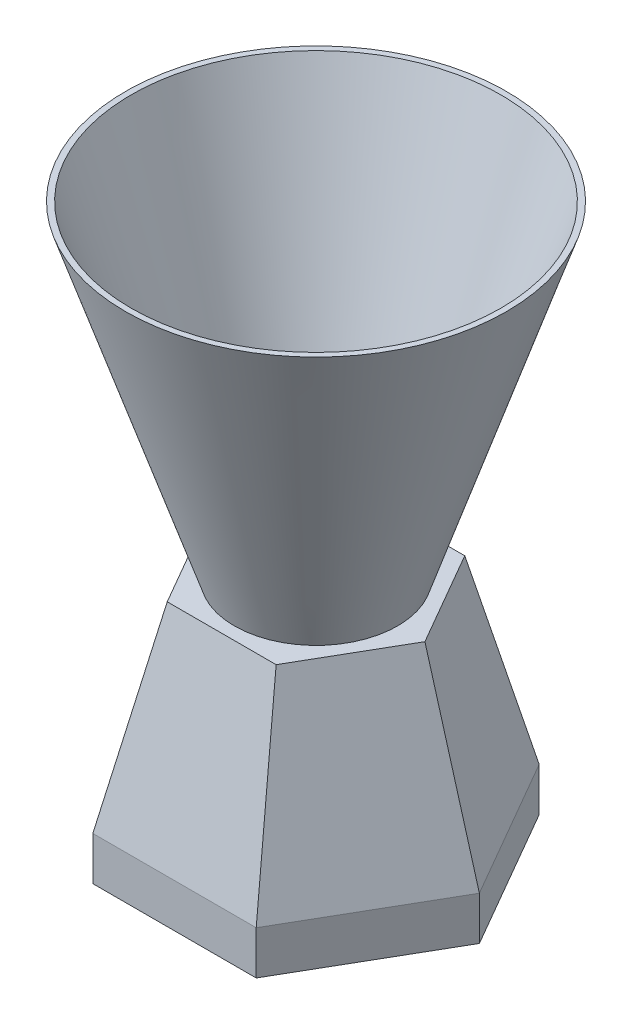
ISO-10303-21;
HEADER;
FILE_DESCRIPTION(('STEP AP214'),'2;1');
FILE_NAME('part.step','',(''),(''),'','','');
FILE_SCHEMA(('AUTOMOTIVE_DESIGN { 1 0 10303 214 1 1 1 1 }'));
ENDSEC;
DATA;
#1=APPLICATION_CONTEXT('core data for automotive mechanical design processes');
#2=APPLICATION_PROTOCOL_DEFINITION('international standard','automotive_design',2000,#1);
#3=PRODUCT_CONTEXT('',#1,'mechanical');
#4=PRODUCT('Part','Part','',(#3));
#5=PRODUCT_RELATED_PRODUCT_CATEGORY('part','',(#4));
#6=PRODUCT_DEFINITION_FORMATION('','',#4);
#7=PRODUCT_DEFINITION_CONTEXT('part definition',#1,'design');
#8=PRODUCT_DEFINITION('design','',#6,#7);
#9=PRODUCT_DEFINITION_SHAPE('','',#8);
#10=(LENGTH_UNIT() NAMED_UNIT(*) SI_UNIT(.MILLI.,.METRE.));
#11=(NAMED_UNIT(*) PLANE_ANGLE_UNIT() SI_UNIT($,.RADIAN.));
#12=(NAMED_UNIT(*) SI_UNIT($,.STERADIAN.) SOLID_ANGLE_UNIT());
#13=UNCERTAINTY_MEASURE_WITH_UNIT(LENGTH_MEASURE(1.E-05),#10,'distance_accuracy_value','');
#14=(GEOMETRIC_REPRESENTATION_CONTEXT(3) GLOBAL_UNCERTAINTY_ASSIGNED_CONTEXT((#13)) GLOBAL_UNIT_ASSIGNED_CONTEXT((#10,
#11,#12)) REPRESENTATION_CONTEXT('',''));
#15=CARTESIAN_POINT('',(0.,0.,0.));
#16=DIRECTION('',(0.,0.,1.));
#17=DIRECTION('',(1.,0.,0.));
#18=AXIS2_PLACEMENT_3D('',#15,#16,#17);
#19=CARTESIAN_POINT('',(-20.,43.,0.));
#20=DIRECTION('',(0.,1.,0.));
#21=DIRECTION('',(0.,0.,1.));
#22=AXIS2_PLACEMENT_3D('',#19,#20,#21);
#23=PLANE('',#22);
#24=CARTESIAN_POINT('',(0.,43.,0.));
#25=DIRECTION('',(0.,1.,0.));
#26=DIRECTION('',(0.,0.,1.));
#27=AXIS2_PLACEMENT_3D('',#24,#25,#26);
#28=CIRCLE('',#27,15.);
#29=CARTESIAN_POINT('',(0.,43.,15.));
#30=VERTEX_POINT('',#29);
#31=EDGE_CURVE('E12',#30,#30,#28,.T.);
#32=ORIENTED_EDGE('',*,*,#31,.F.);
#33=EDGE_LOOP('',(#32));
#34=FACE_BOUND('',#33,.T.);
#35=DIRECTION('',(-0.499999999999999,0.,0.866025403784439));
#36=VECTOR('',#35,1.);
#37=CARTESIAN_POINT('',(-10.,43.,-17.3205080756888));
#38=LINE('',#37,#36);
#39=CARTESIAN_POINT('',(-10.,43.,-17.3205080756888));
#40=VERTEX_POINT('',#39);
#41=CARTESIAN_POINT('',(-20.,43.,0.));
#42=VERTEX_POINT('',#41);
#43=EDGE_CURVE('E152',#40,#42,#38,.T.);
#44=ORIENTED_EDGE('',*,*,#43,.T.);
#45=DIRECTION('',(0.5,0.,0.866025403784439));
#46=VECTOR('',#45,1.);
#47=CARTESIAN_POINT('',(-20.,43.,0.));
#48=LINE('',#47,#46);
#49=CARTESIAN_POINT('',(-9.99999999999999,43.,17.3205080756888));
#50=VERTEX_POINT('',#49);
#51=EDGE_CURVE('E136',#42,#50,#48,.T.);
#52=ORIENTED_EDGE('',*,*,#51,.T.);
#53=DIRECTION('',(1.,0.,0.));
#54=VECTOR('',#53,1.);
#55=CARTESIAN_POINT('',(-9.99999999999999,43.,17.3205080756888));
#56=LINE('',#55,#54);
#57=CARTESIAN_POINT('',(10.,43.,17.3205080756888));
#58=VERTEX_POINT('',#57);
#59=EDGE_CURVE('E123',#50,#58,#56,.T.);
#60=ORIENTED_EDGE('',*,*,#59,.T.);
#61=DIRECTION('',(0.5,0.,-0.866025403784439));
#62=VECTOR('',#61,1.);
#63=CARTESIAN_POINT('',(10.,43.,17.3205080756888));
#64=LINE('',#63,#62);
#65=CARTESIAN_POINT('',(20.,43.,0.));
#66=VERTEX_POINT('',#65);
#67=EDGE_CURVE('E135',#58,#66,#64,.T.);
#68=ORIENTED_EDGE('',*,*,#67,.T.);
#69=DIRECTION('',(-0.5,0.,-0.866025403784439));
#70=VECTOR('',#69,1.);
#71=CARTESIAN_POINT('',(20.,43.,0.));
#72=LINE('',#71,#70);
#73=CARTESIAN_POINT('',(10.,43.,-17.3205080756888));
#74=VERTEX_POINT('',#73);
#75=EDGE_CURVE('E210',#66,#74,#72,.T.);
#76=ORIENTED_EDGE('',*,*,#75,.T.);
#77=DIRECTION('',(-1.,0.,0.));
#78=VECTOR('',#77,1.);
#79=CARTESIAN_POINT('',(10.,43.,-17.3205080756888));
#80=LINE('',#79,#78);
#81=EDGE_CURVE('E257',#74,#40,#80,.T.);
#82=ORIENTED_EDGE('',*,*,#81,.T.);
#83=EDGE_LOOP('',(#44,#52,#60,#68,#76,#82));
#84=FACE_BOUND('',#83,.T.);
#85=ADVANCED_FACE('F45',(#34,#84),#23,.T.);
#86=CARTESIAN_POINT('',(15.,8.,25.9807621135332));
#87=DIRECTION('',(-0.866025403784439,0.,-0.499999999999999));
#88=DIRECTION('',(-0.5,0.,0.866025403784439));
#89=AXIS2_PLACEMENT_3D('',#86,#87,#88);
#90=PLANE('',#89);
#91=DIRECTION('',(0.499999999999999,0.,-0.866025403784439));
#92=VECTOR('',#91,1.);
#93=CARTESIAN_POINT('',(15.,0.,25.9807621135332));
#94=LINE('',#93,#92);
#95=CARTESIAN_POINT('',(15.,0.,25.9807621135332));
#96=VERTEX_POINT('',#95);
#97=CARTESIAN_POINT('',(30.,0.,0.));
#98=VERTEX_POINT('',#97);
#99=EDGE_CURVE('E147',#96,#98,#94,.T.);
#100=ORIENTED_EDGE('',*,*,#99,.T.);
#101=DIRECTION('',(0.,-1.,0.));
#102=VECTOR('',#101,1.);
#103=CARTESIAN_POINT('',(30.,8.,0.));
#104=LINE('',#103,#102);
#105=CARTESIAN_POINT('',(30.,7.99999999999997,0.));
#106=VERTEX_POINT('',#105);
#107=EDGE_CURVE('E332',#106,#98,#104,.T.);
#108=ORIENTED_EDGE('',*,*,#107,.F.);
#109=DIRECTION('',(-0.5,0.,0.866025403784439));
#110=VECTOR('',#109,1.);
#111=CARTESIAN_POINT('',(27.5,7.99999999999997,4.33012701892219));
#112=LINE('',#111,#110);
#113=CARTESIAN_POINT('',(15.0000000000002,7.99999999999994,25.9807621135331));
#114=VERTEX_POINT('',#113);
#115=EDGE_CURVE('E328',#114,#106,#112,.F.);
#116=ORIENTED_EDGE('',*,*,#115,.F.);
#117=DIRECTION('',(0.,-1.,0.));
#118=VECTOR('',#117,1.);
#119=CARTESIAN_POINT('',(15.,8.,25.9807621135332));
#120=LINE('',#119,#118);
#121=EDGE_CURVE('E344',#114,#96,#120,.T.);
#122=ORIENTED_EDGE('',*,*,#121,.T.);
#123=EDGE_LOOP('',(#100,#108,#116,#122));
#124=FACE_BOUND('',#123,.T.);
#125=ADVANCED_FACE('F47',(#124),#90,.F.);
#126=CARTESIAN_POINT('',(30.,8.,0.));
#127=DIRECTION('',(-0.866025403784439,0.,0.5));
#128=DIRECTION('',(0.5,0.,0.866025403784439));
#129=AXIS2_PLACEMENT_3D('',#126,#127,#128);
#130=PLANE('',#129);
#131=DIRECTION('',(-0.5,0.,-0.866025403784439));
#132=VECTOR('',#131,1.);
#133=CARTESIAN_POINT('',(30.,0.,0.));
#134=LINE('',#133,#132);
#135=CARTESIAN_POINT('',(15.,0.,-25.9807621135332));
#136=VERTEX_POINT('',#135);
#137=EDGE_CURVE('E367',#98,#136,#134,.T.);
#138=ORIENTED_EDGE('',*,*,#137,.T.);
#139=DIRECTION('',(0.,-1.,0.));
#140=VECTOR('',#139,1.);
#141=CARTESIAN_POINT('',(15.,8.,-25.9807621135332));
#142=LINE('',#141,#140);
#143=CARTESIAN_POINT('',(15.,7.99999999999999,-25.9807621135331));
#144=VERTEX_POINT('',#143);
#145=EDGE_CURVE('E335',#144,#136,#142,.T.);
#146=ORIENTED_EDGE('',*,*,#145,.F.);
#147=DIRECTION('',(0.5,0.,0.866025403784439));
#148=VECTOR('',#147,1.);
#149=CARTESIAN_POINT('',(17.5,8.,-21.6506350946109));
#150=LINE('',#149,#148);
#151=EDGE_CURVE('E79',#106,#144,#150,.F.);
#152=ORIENTED_EDGE('',*,*,#151,.F.);
#153=ORIENTED_EDGE('',*,*,#107,.T.);
#154=EDGE_LOOP('',(#138,#146,#152,#153));
#155=FACE_BOUND('',#154,.T.);
#156=ADVANCED_FACE('F378',(#155),#130,.F.);
#157=CARTESIAN_POINT('',(15.,8.,-25.9807621135332));
#158=DIRECTION('',(0.,0.,1.));
#159=DIRECTION('',(1.,0.,0.));
#160=AXIS2_PLACEMENT_3D('',#157,#158,#159);
#161=PLANE('',#160);
#162=DIRECTION('',(-1.,0.,0.));
#163=VECTOR('',#162,1.);
#164=CARTESIAN_POINT('',(15.,0.,-25.9807621135332));
#165=LINE('',#164,#163);
#166=CARTESIAN_POINT('',(-15.,0.,-25.9807621135332));
#167=VERTEX_POINT('',#166);
#168=EDGE_CURVE('E364',#136,#167,#165,.T.);
#169=ORIENTED_EDGE('',*,*,#168,.T.);
#170=DIRECTION('',(0.,-1.,0.));
#171=VECTOR('',#170,1.);
#172=CARTESIAN_POINT('',(-15.,8.,-25.9807621135332));
#173=LINE('',#172,#171);
#174=CARTESIAN_POINT('',(-15.,7.99999999999997,-25.9807621135331));
#175=VERTEX_POINT('',#174);
#176=EDGE_CURVE('E338',#175,#167,#173,.T.);
#177=ORIENTED_EDGE('',*,*,#176,.F.);
#178=DIRECTION('',(1.,0.,0.));
#179=VECTOR('',#178,1.);
#180=CARTESIAN_POINT('',(-10.,7.99999999999997,-25.9807621135331));
#181=LINE('',#180,#179);
#182=EDGE_CURVE('E322',#144,#175,#181,.F.);
#183=ORIENTED_EDGE('',*,*,#182,.F.);
#184=ORIENTED_EDGE('',*,*,#145,.T.);
#185=EDGE_LOOP('',(#169,#177,#183,#184));
#186=FACE_BOUND('',#185,.T.);
#187=ADVANCED_FACE('F379',(#186),#161,.F.);
#188=CARTESIAN_POINT('',(-15.,8.,-25.9807621135332));
#189=DIRECTION('',(0.866025403784439,0.,0.5));
#190=DIRECTION('',(0.5,0.,-0.866025403784439));
#191=AXIS2_PLACEMENT_3D('',#188,#189,#190);
#192=PLANE('',#191);
#193=DIRECTION('',(-0.5,0.,0.866025403784439));
#194=VECTOR('',#193,1.);
#195=CARTESIAN_POINT('',(-15.,0.,-25.9807621135332));
#196=LINE('',#195,#194);
#197=CARTESIAN_POINT('',(-30.,0.,0.));
#198=VERTEX_POINT('',#197);
#199=EDGE_CURVE('E360',#167,#198,#196,.T.);
#200=ORIENTED_EDGE('',*,*,#199,.T.);
#201=DIRECTION('',(0.,-1.,0.));
#202=VECTOR('',#201,1.);
#203=CARTESIAN_POINT('',(-30.,8.,0.));
#204=LINE('',#203,#202);
#205=CARTESIAN_POINT('',(-29.9999999999999,7.99999999999996,0.));
#206=VERTEX_POINT('',#205);
#207=EDGE_CURVE('E349',#206,#198,#204,.T.);
#208=ORIENTED_EDGE('',*,*,#207,.F.);
#209=DIRECTION('',(0.499999999999999,0.,-0.866025403784439));
#210=VECTOR('',#209,1.);
#211=CARTESIAN_POINT('',(-27.4999999999999,7.99999999999997,-4.33012701892213));
#212=LINE('',#211,#210);
#213=EDGE_CURVE('E325',#175,#206,#212,.F.);
#214=ORIENTED_EDGE('',*,*,#213,.F.);
#215=ORIENTED_EDGE('',*,*,#176,.T.);
#216=EDGE_LOOP('',(#200,#208,#214,#215));
#217=FACE_BOUND('',#216,.T.);
#218=ADVANCED_FACE('F359',(#217),#192,.F.);
#219=CARTESIAN_POINT('',(-30.,8.,0.));
#220=DIRECTION('',(0.866025403784439,0.,-0.5));
#221=DIRECTION('',(-0.5,0.,-0.866025403784439));
#222=AXIS2_PLACEMENT_3D('',#219,#220,#221);
#223=PLANE('',#222);
#224=DIRECTION('',(0.5,0.,0.866025403784439));
#225=VECTOR('',#224,1.);
#226=CARTESIAN_POINT('',(-30.,0.,0.));
#227=LINE('',#226,#225);
#228=CARTESIAN_POINT('',(-15.,0.,25.9807621135332));
#229=VERTEX_POINT('',#228);
#230=EDGE_CURVE('E365',#198,#229,#227,.T.);
#231=ORIENTED_EDGE('',*,*,#230,.T.);
#232=DIRECTION('',(0.,-1.,0.));
#233=VECTOR('',#232,1.);
#234=CARTESIAN_POINT('',(-15.,8.,25.9807621135332));
#235=LINE('',#234,#233);
#236=CARTESIAN_POINT('',(-14.9999999999998,7.99999999999993,25.9807621135331));
#237=VERTEX_POINT('',#236);
#238=EDGE_CURVE('E62',#237,#229,#235,.T.);
#239=ORIENTED_EDGE('',*,*,#238,.F.);
#240=DIRECTION('',(-0.5,0.,-0.866025403784439));
#241=VECTOR('',#240,1.);
#242=CARTESIAN_POINT('',(-17.4999999999999,7.99999999999993,21.6506350946109));
#243=LINE('',#242,#241);
#244=EDGE_CURVE('E146',#206,#237,#243,.F.);
#245=ORIENTED_EDGE('',*,*,#244,.F.);
#246=ORIENTED_EDGE('',*,*,#207,.T.);
#247=EDGE_LOOP('',(#231,#239,#245,#246));
#248=FACE_BOUND('',#247,.T.);
#249=ADVANCED_FACE('F386',(#248),#223,.F.);
#250=CARTESIAN_POINT('',(-15.,8.,25.9807621135332));
#251=DIRECTION('',(0.,0.,-1.));
#252=DIRECTION('',(-1.,0.,0.));
#253=AXIS2_PLACEMENT_3D('',#250,#251,#252);
#254=PLANE('',#253);
#255=DIRECTION('',(1.,0.,0.));
#256=VECTOR('',#255,1.);
#257=CARTESIAN_POINT('',(-15.,0.,25.9807621135332));
#258=LINE('',#257,#256);
#259=EDGE_CURVE('E86',#229,#96,#258,.T.);
#260=ORIENTED_EDGE('',*,*,#259,.T.);
#261=ORIENTED_EDGE('',*,*,#121,.F.);
#262=DIRECTION('',(1.,0.,0.));
#263=VECTOR('',#262,1.);
#264=CARTESIAN_POINT('',(10.,7.99999999999992,25.980762113533));
#265=LINE('',#264,#263);
#266=EDGE_CURVE('E343',#237,#114,#265,.T.);
#267=ORIENTED_EDGE('',*,*,#266,.F.);
#268=ORIENTED_EDGE('',*,*,#238,.T.);
#269=EDGE_LOOP('',(#260,#261,#267,#268));
#270=FACE_BOUND('',#269,.T.);
#271=ADVANCED_FACE('F412',(#270),#254,.F.);
#272=CARTESIAN_POINT('',(30.,0.,0.));
#273=DIRECTION('',(0.,1.,0.));
#274=DIRECTION('',(0.,0.,1.));
#275=AXIS2_PLACEMENT_3D('',#272,#273,#274);
#276=PLANE('',#275);
#277=ORIENTED_EDGE('',*,*,#99,.F.);
#278=ORIENTED_EDGE('',*,*,#259,.F.);
#279=ORIENTED_EDGE('',*,*,#230,.F.);
#280=ORIENTED_EDGE('',*,*,#199,.F.);
#281=ORIENTED_EDGE('',*,*,#168,.F.);
#282=ORIENTED_EDGE('',*,*,#137,.F.);
#283=EDGE_LOOP('',(#277,#278,#279,#280,#281,#282));
#284=FACE_BOUND('',#283,.T.);
#285=ADVANCED_FACE('F176',(#284),#276,.F.);
#286=CARTESIAN_POINT('',(10.,43.,17.3205080756888));
#287=DIRECTION('',(0.,-0.240192230707626,-0.970725343394152));
#288=DIRECTION('',(0.,0.970725343394152,-0.240192230707626));
#289=AXIS2_PLACEMENT_3D('',#286,#287,#288);
#290=PLANE('',#289);
#291=DIRECTION('',(-0.137360563948697,0.961523947640823,-0.237915475715438));
#292=VECTOR('',#291,1.);
#293=CARTESIAN_POINT('',(15.0000000000003,8.,25.980762113533));
#294=LINE('',#293,#292);
#295=EDGE_CURVE('E130',#114,#58,#294,.T.);
#296=ORIENTED_EDGE('',*,*,#295,.T.);
#297=ORIENTED_EDGE('',*,*,#59,.F.);
#298=DIRECTION('',(0.137360563948682,0.961523947640823,-0.237915475715447));
#299=VECTOR('',#298,1.);
#300=CARTESIAN_POINT('',(-14.9999999999997,8.,25.9807621135333));
#301=LINE('',#300,#299);
#302=EDGE_CURVE('E128',#237,#50,#301,.T.);
#303=ORIENTED_EDGE('',*,*,#302,.F.);
#304=ORIENTED_EDGE('',*,*,#266,.T.);
#305=EDGE_LOOP('',(#296,#297,#303,#304));
#306=FACE_BOUND('',#305,.T.);
#307=ADVANCED_FACE('F126',(#306),#290,.F.);
#308=CARTESIAN_POINT('',(-9.99999999999999,43.,17.3205080756888));
#309=DIRECTION('',(0.840672807476708,-0.240192230707627,-0.485362671697076));
#310=DIRECTION('',(-0.5,0.,-0.866025403784439));
#311=AXIS2_PLACEMENT_3D('',#308,#309,#310);
#312=PLANE('',#311);
#313=ORIENTED_EDGE('',*,*,#302,.T.);
#314=ORIENTED_EDGE('',*,*,#51,.F.);
#315=DIRECTION('',(0.274721127897378,0.961523947640823,0.));
#316=VECTOR('',#315,1.);
#317=CARTESIAN_POINT('',(-30.,8.,2.13062446810531E-13));
#318=LINE('',#317,#316);
#319=EDGE_CURVE('E259',#206,#42,#318,.T.);
#320=ORIENTED_EDGE('',*,*,#319,.F.);
#321=ORIENTED_EDGE('',*,*,#244,.T.);
#322=EDGE_LOOP('',(#313,#314,#320,#321));
#323=FACE_BOUND('',#322,.T.);
#324=ADVANCED_FACE('F142',(#323),#312,.F.);
#325=CARTESIAN_POINT('',(20.,43.,0.));
#326=DIRECTION('',(-0.840672807476708,-0.240192230707631,-0.485362671697075));
#327=DIRECTION('',(-0.5,0.,0.866025403784439));
#328=AXIS2_PLACEMENT_3D('',#325,#326,#327);
#329=PLANE('',#328);
#330=DIRECTION('',(-0.274721127897378,0.961523947640823,0.));
#331=VECTOR('',#330,1.);
#332=CARTESIAN_POINT('',(30.,8.,0.));
#333=LINE('',#332,#331);
#334=EDGE_CURVE('E220',#106,#66,#333,.T.);
#335=ORIENTED_EDGE('',*,*,#334,.T.);
#336=ORIENTED_EDGE('',*,*,#67,.F.);
#337=ORIENTED_EDGE('',*,*,#295,.F.);
#338=ORIENTED_EDGE('',*,*,#115,.T.);
#339=EDGE_LOOP('',(#335,#336,#337,#338));
#340=FACE_BOUND('',#339,.T.);
#341=ADVANCED_FACE('F217',(#340),#329,.F.);
#342=CARTESIAN_POINT('',(10.,43.,-17.3205080756888));
#343=DIRECTION('',(-0.840672807476708,-0.240192230707629,0.485362671697076));
#344=DIRECTION('',(0.5,0.,0.866025403784439));
#345=AXIS2_PLACEMENT_3D('',#342,#343,#344);
#346=PLANE('',#345);
#347=DIRECTION('',(-0.137360563948687,0.961523947640823,0.237915475715444));
#348=VECTOR('',#347,1.);
#349=CARTESIAN_POINT('',(14.9999999999999,8.,-25.9807621135332));
#350=LINE('',#349,#348);
#351=EDGE_CURVE('E276',#144,#74,#350,.T.);
#352=ORIENTED_EDGE('',*,*,#351,.T.);
#353=ORIENTED_EDGE('',*,*,#75,.F.);
#354=ORIENTED_EDGE('',*,*,#334,.F.);
#355=ORIENTED_EDGE('',*,*,#151,.T.);
#356=EDGE_LOOP('',(#352,#353,#354,#355));
#357=FACE_BOUND('',#356,.T.);
#358=ADVANCED_FACE('F239',(#357),#346,.F.);
#359=CARTESIAN_POINT('',(-10.,43.,-17.3205080756888));
#360=DIRECTION('',(0.,-0.240192230707628,0.970725343394152));
#361=DIRECTION('',(0.,-0.970725343394152,-0.240192230707628));
#362=AXIS2_PLACEMENT_3D('',#359,#360,#361);
#363=PLANE('',#362);
#364=DIRECTION('',(0.137360563948692,0.961523947640823,0.237915475715441));
#365=VECTOR('',#364,1.);
#366=CARTESIAN_POINT('',(-15.0000000000001,8.,-25.9807621135331));
#367=LINE('',#366,#365);
#368=EDGE_CURVE('E280',#175,#40,#367,.T.);
#369=ORIENTED_EDGE('',*,*,#368,.T.);
#370=ORIENTED_EDGE('',*,*,#81,.F.);
#371=ORIENTED_EDGE('',*,*,#351,.F.);
#372=ORIENTED_EDGE('',*,*,#182,.T.);
#373=EDGE_LOOP('',(#369,#370,#371,#372));
#374=FACE_BOUND('',#373,.T.);
#375=ADVANCED_FACE('F243',(#374),#363,.F.);
#376=CARTESIAN_POINT('',(-20.,43.,0.));
#377=DIRECTION('',(0.840672807476708,-0.240192230707628,0.485362671697075));
#378=DIRECTION('',(0.499999999999999,0.,-0.866025403784439));
#379=AXIS2_PLACEMENT_3D('',#376,#377,#378);
#380=PLANE('',#379);
#381=ORIENTED_EDGE('',*,*,#319,.T.);
#382=ORIENTED_EDGE('',*,*,#43,.F.);
#383=ORIENTED_EDGE('',*,*,#368,.F.);
#384=ORIENTED_EDGE('',*,*,#213,.T.);
#385=EDGE_LOOP('',(#381,#382,#383,#384));
#386=FACE_BOUND('',#385,.T.);
#387=ADVANCED_FACE('F173',(#386),#380,.F.);
#388=CARTESIAN_POINT('',(33.9459074466106,103.,0.));
#389=DIRECTION('',(0.,1.,0.));
#390=DIRECTION('',(-1.,0.,0.));
#391=AXIS2_PLACEMENT_3D('',#388,#389,#390);
#392=PLANE('',#391);
#393=CARTESIAN_POINT('',(0.,103.,0.));
#394=DIRECTION('',(0.,-1.,0.));
#395=DIRECTION('',(1.,0.,0.));
#396=AXIS2_PLACEMENT_3D('',#393,#394,#395);
#397=CIRCLE('',#396,33.9459074466106);
#398=CARTESIAN_POINT('',(33.9459074466106,103.,0.));
#399=VERTEX_POINT('',#398);
#400=EDGE_CURVE('E263',#399,#399,#397,.T.);
#401=ORIENTED_EDGE('',*,*,#400,.T.);
#402=EDGE_LOOP('',(#401));
#403=FACE_BOUND('',#402,.T.);
#404=CARTESIAN_POINT('',(0.,103.,0.));
#405=DIRECTION('',(0.,-1.,0.));
#406=DIRECTION('',(1.,0.,0.));
#407=AXIS2_PLACEMENT_3D('',#404,#405,#406);
#408=CIRCLE('',#407,35.);
#409=CARTESIAN_POINT('',(35.,103.,0.));
#410=VERTEX_POINT('',#409);
#411=EDGE_CURVE('E261',#410,#410,#408,.T.);
#412=ORIENTED_EDGE('',*,*,#411,.F.);
#413=EDGE_LOOP('',(#412));
#414=FACE_BOUND('',#413,.T.);
#415=ADVANCED_FACE('F397',(#403,#414),#392,.T.);
#416=CARTESIAN_POINT('',(0.,43.,0.));
#417=DIRECTION('',(0.,1.,0.));
#418=DIRECTION('',(-1.,0.,0.));
#419=AXIS2_PLACEMENT_3D('',#416,#417,#418);
#420=CONICAL_SURFACE('',#419,15.,0.321750554396642);
#421=ORIENTED_EDGE('',*,*,#411,.T.);
#422=EDGE_LOOP('',(#421));
#423=FACE_BOUND('',#422,.T.);
#424=ORIENTED_EDGE('',*,*,#31,.T.);
#425=EDGE_LOOP('',(#424));
#426=FACE_BOUND('',#425,.T.);
#427=ADVANCED_FACE('F395',(#423,#426),#420,.T.);
#428=CARTESIAN_POINT('',(0.,103.,0.));
#429=DIRECTION('',(0.,1.,0.));
#430=DIRECTION('',(-1.,0.,0.));
#431=AXIS2_PLACEMENT_3D('',#428,#429,#430);
#432=CONICAL_SURFACE('',#431,33.9459074466106,0.321750554396643);
#433=CARTESIAN_POINT('',(0.,43.,0.));
#434=DIRECTION('',(0.,1.,0.));
#435=DIRECTION('',(0.,0.,1.));
#436=AXIS2_PLACEMENT_3D('',#433,#434,#435);
#437=CIRCLE('',#436,13.9459074466105);
#438=CARTESIAN_POINT('',(0.,43.,13.9459074466105));
#439=VERTEX_POINT('',#438);
#440=EDGE_CURVE('E54',#439,#439,#437,.F.);
#441=ORIENTED_EDGE('',*,*,#440,.T.);
#442=EDGE_LOOP('',(#441));
#443=FACE_BOUND('',#442,.T.);
#444=ORIENTED_EDGE('',*,*,#400,.F.);
#445=EDGE_LOOP('',(#444));
#446=FACE_BOUND('',#445,.T.);
#447=ADVANCED_FACE('F171',(#443,#446),#432,.F.);
#448=ORIENTED_EDGE('',*,*,#440,.F.);
#449=EDGE_LOOP('',(#448));
#450=FACE_BOUND('',#449,.T.);
#451=ADVANCED_FACE('F161',(#450),#23,.T.);
#452=CLOSED_SHELL('',(#85,#125,#156,#187,#218,#249,#271,#285,#307,#324,#341,#358,#375,#387,#415,
#427,#447,#451));
#453=MANIFOLD_SOLID_BREP('B2',#452);
#454=ADVANCED_BREP_SHAPE_REPRESENTATION('',(#18,#453),#14);
#455=SHAPE_DEFINITION_REPRESENTATION(#9,#454);
ENDSEC;
END-ISO-10303-21;
